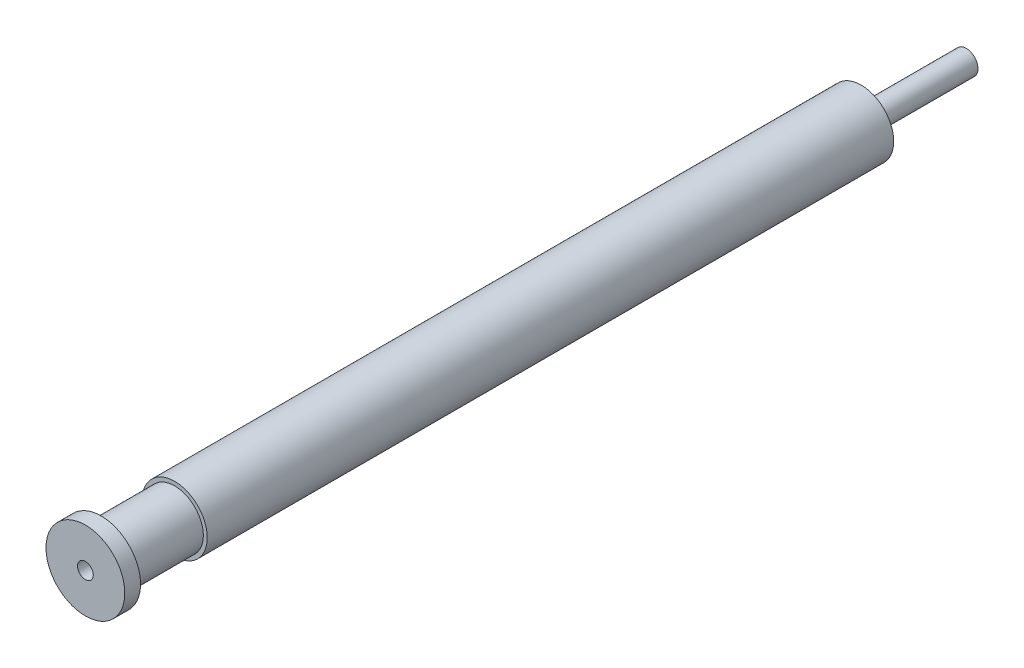
ISO-10303-21;
HEADER;
FILE_DESCRIPTION(('STEP AP214'),'2;1');
FILE_NAME('part.step','',(''),(''),'','','');
FILE_SCHEMA(('AUTOMOTIVE_DESIGN { 1 0 10303 214 1 1 1 1 }'));
ENDSEC;
DATA;
#1=APPLICATION_CONTEXT('core data for automotive mechanical design processes');
#2=APPLICATION_PROTOCOL_DEFINITION('international standard','automotive_design',2000,#1);
#3=PRODUCT_CONTEXT('',#1,'mechanical');
#4=PRODUCT('Part','Part','',(#3));
#5=PRODUCT_RELATED_PRODUCT_CATEGORY('part','',(#4));
#6=PRODUCT_DEFINITION_FORMATION('','',#4);
#7=PRODUCT_DEFINITION_CONTEXT('part definition',#1,'design');
#8=PRODUCT_DEFINITION('design','',#6,#7);
#9=PRODUCT_DEFINITION_SHAPE('','',#8);
#10=(LENGTH_UNIT() NAMED_UNIT(*) SI_UNIT(.MILLI.,.METRE.));
#11=(NAMED_UNIT(*) PLANE_ANGLE_UNIT() SI_UNIT($,.RADIAN.));
#12=(NAMED_UNIT(*) SI_UNIT($,.STERADIAN.) SOLID_ANGLE_UNIT());
#13=UNCERTAINTY_MEASURE_WITH_UNIT(LENGTH_MEASURE(1.E-05),#10,'distance_accuracy_value','');
#14=(GEOMETRIC_REPRESENTATION_CONTEXT(3) GLOBAL_UNCERTAINTY_ASSIGNED_CONTEXT((#13)) GLOBAL_UNIT_ASSIGNED_CONTEXT((#10,
#11,#12)) REPRESENTATION_CONTEXT('',''));
#15=CARTESIAN_POINT('',(0.,0.,0.));
#16=DIRECTION('',(0.,0.,1.));
#17=DIRECTION('',(1.,0.,0.));
#18=AXIS2_PLACEMENT_3D('',#15,#16,#17);
#19=CARTESIAN_POINT('',(25.9932499833334,0.,-27.8475545000964));
#20=DIRECTION('',(0.,0.,1.));
#21=DIRECTION('',(1.,0.,0.));
#22=AXIS2_PLACEMENT_3D('',#19,#20,#21);
#23=PLANE('',#22);
#24=CARTESIAN_POINT('',(24.8682499833335,0.,-27.8475545000964));
#25=DIRECTION('',(0.,0.,1.));
#26=DIRECTION('',(1.,0.,0.));
#27=AXIS2_PLACEMENT_3D('',#24,#25,#26);
#28=CIRCLE('',#27,0.750000000000002);
#29=CARTESIAN_POINT('',(25.6182499833335,0.,-27.8475545000964));
#30=VERTEX_POINT('',#29);
#31=EDGE_CURVE('E64',#30,#30,#28,.T.);
#32=ORIENTED_EDGE('',*,*,#31,.T.);
#33=EDGE_LOOP('',(#32));
#34=FACE_BOUND('',#33,.T.);
#35=CARTESIAN_POINT('',(24.8682499833334,0.,-27.8475545000964));
#36=DIRECTION('',(0.,0.,-1.));
#37=DIRECTION('',(-1.,0.,0.));
#38=AXIS2_PLACEMENT_3D('',#35,#36,#37);
#39=CIRCLE('',#38,1.12500000000001);
#40=CARTESIAN_POINT('',(23.7432499833334,0.,-27.8475545000964));
#41=VERTEX_POINT('',#40);
#42=EDGE_CURVE('E10',#41,#41,#39,.T.);
#43=ORIENTED_EDGE('',*,*,#42,.T.);
#44=EDGE_LOOP('',(#43));
#45=FACE_BOUND('',#44,.T.);
#46=ADVANCED_FACE('F33',(#34,#45),#23,.F.);
#47=CARTESIAN_POINT('',(24.8682499833334,0.,-17.0056108200556));
#48=DIRECTION('',(0.,0.,-1.));
#49=DIRECTION('',(-1.,0.,0.));
#50=AXIS2_PLACEMENT_3D('',#47,#48,#49);
#51=CYLINDRICAL_SURFACE('',#50,1.125);
#52=ORIENTED_EDGE('',*,*,#42,.F.);
#53=EDGE_LOOP('',(#52));
#54=FACE_BOUND('',#53,.T.);
#55=CARTESIAN_POINT('',(24.8682499833334,0.,-17.8475545000964));
#56=DIRECTION('',(0.,0.,-1.));
#57=DIRECTION('',(-1.,0.,0.));
#58=AXIS2_PLACEMENT_3D('',#55,#56,#57);
#59=CIRCLE('',#58,1.125);
#60=CARTESIAN_POINT('',(23.7432499833334,0.,-17.8475545000964));
#61=VERTEX_POINT('',#60);
#62=EDGE_CURVE('E39',#61,#61,#59,.T.);
#63=ORIENTED_EDGE('',*,*,#62,.T.);
#64=EDGE_LOOP('',(#63));
#65=FACE_BOUND('',#64,.T.);
#66=ADVANCED_FACE('F97',(#54,#65),#51,.T.);
#67=CARTESIAN_POINT('',(25.9932499833334,0.,-17.8475545000964));
#68=DIRECTION('',(0.,0.,1.));
#69=DIRECTION('',(1.,0.,0.));
#70=AXIS2_PLACEMENT_3D('',#67,#68,#69);
#71=PLANE('',#70);
#72=ORIENTED_EDGE('',*,*,#62,.F.);
#73=EDGE_LOOP('',(#72));
#74=FACE_BOUND('',#73,.T.);
#75=CARTESIAN_POINT('',(24.8682499833334,0.,-17.8475545000964));
#76=DIRECTION('',(0.,0.,-1.));
#77=DIRECTION('',(-1.,0.,0.));
#78=AXIS2_PLACEMENT_3D('',#75,#76,#77);
#79=CIRCLE('',#78,3.1);
#80=CARTESIAN_POINT('',(21.7682499833334,0.,-17.8475545000964));
#81=VERTEX_POINT('',#80);
#82=EDGE_CURVE('E43',#81,#81,#79,.T.);
#83=ORIENTED_EDGE('',*,*,#82,.T.);
#84=EDGE_LOOP('',(#83));
#85=FACE_BOUND('',#84,.T.);
#86=ADVANCED_FACE('F101',(#74,#85),#71,.F.);
#87=CARTESIAN_POINT('',(24.8682499833334,0.,-17.0056108200556));
#88=DIRECTION('',(0.,0.,-1.));
#89=DIRECTION('',(-1.,0.,0.));
#90=AXIS2_PLACEMENT_3D('',#87,#88,#89);
#91=CYLINDRICAL_SURFACE('',#90,3.1);
#92=ORIENTED_EDGE('',*,*,#82,.F.);
#93=EDGE_LOOP('',(#92));
#94=FACE_BOUND('',#93,.T.);
#95=CARTESIAN_POINT('',(24.8682499833335,0.,47.4943891799444));
#96=DIRECTION('',(0.,0.,-1.));
#97=DIRECTION('',(-1.,0.,0.));
#98=AXIS2_PLACEMENT_3D('',#95,#96,#97);
#99=CIRCLE('',#98,3.1);
#100=CARTESIAN_POINT('',(21.7682499833335,0.,47.4943891799444));
#101=VERTEX_POINT('',#100);
#102=EDGE_CURVE('E47',#101,#101,#99,.T.);
#103=ORIENTED_EDGE('',*,*,#102,.T.);
#104=EDGE_LOOP('',(#103));
#105=FACE_BOUND('',#104,.T.);
#106=ADVANCED_FACE('F106',(#94,#105),#91,.T.);
#107=CARTESIAN_POINT('',(27.5932499833334,0.,47.4943891799444));
#108=DIRECTION('',(0.,0.,-1.));
#109=DIRECTION('',(-1.,0.,0.));
#110=AXIS2_PLACEMENT_3D('',#107,#108,#109);
#111=PLANE('',#110);
#112=ORIENTED_EDGE('',*,*,#102,.F.);
#113=EDGE_LOOP('',(#112));
#114=FACE_BOUND('',#113,.T.);
#115=CARTESIAN_POINT('',(24.8682499833335,0.,47.4943891799444));
#116=DIRECTION('',(0.,0.,-1.));
#117=DIRECTION('',(-1.,0.,0.));
#118=AXIS2_PLACEMENT_3D('',#115,#116,#117);
#119=CIRCLE('',#118,2.72499999999999);
#120=CARTESIAN_POINT('',(22.1432499833335,0.,47.4943891799444));
#121=VERTEX_POINT('',#120);
#122=EDGE_CURVE('E52',#121,#121,#119,.T.);
#123=ORIENTED_EDGE('',*,*,#122,.T.);
#124=EDGE_LOOP('',(#123));
#125=FACE_BOUND('',#124,.T.);
#126=ADVANCED_FACE('F112',(#114,#125),#111,.F.);
#127=CARTESIAN_POINT('',(24.8682499833334,0.,-17.0056108200556));
#128=DIRECTION('',(0.,0.,-1.));
#129=DIRECTION('',(-1.,0.,0.));
#130=AXIS2_PLACEMENT_3D('',#127,#128,#129);
#131=CYLINDRICAL_SURFACE('',#130,2.72499999999999);
#132=ORIENTED_EDGE('',*,*,#122,.F.);
#133=EDGE_LOOP('',(#132));
#134=FACE_BOUND('',#133,.T.);
#135=CARTESIAN_POINT('',(24.8682499833335,0.,54.4943891799444));
#136=DIRECTION('',(0.,0.,-1.));
#137=DIRECTION('',(-1.,0.,0.));
#138=AXIS2_PLACEMENT_3D('',#135,#136,#137);
#139=CIRCLE('',#138,2.72499999999999);
#140=CARTESIAN_POINT('',(22.1432499833335,0.,54.4943891799444));
#141=VERTEX_POINT('',#140);
#142=EDGE_CURVE('E55',#141,#141,#139,.T.);
#143=ORIENTED_EDGE('',*,*,#142,.T.);
#144=EDGE_LOOP('',(#143));
#145=FACE_BOUND('',#144,.T.);
#146=ADVANCED_FACE('F92',(#134,#145),#131,.T.);
#147=CARTESIAN_POINT('',(27.5932499833335,0.,54.4943891799444));
#148=DIRECTION('',(0.,0.,1.));
#149=DIRECTION('',(1.,0.,0.));
#150=AXIS2_PLACEMENT_3D('',#147,#148,#149);
#151=PLANE('',#150);
#152=ORIENTED_EDGE('',*,*,#142,.F.);
#153=EDGE_LOOP('',(#152));
#154=FACE_BOUND('',#153,.T.);
#155=CARTESIAN_POINT('',(24.8682499833335,0.,54.4943891799444));
#156=DIRECTION('',(0.,0.,-1.));
#157=DIRECTION('',(-1.,0.,0.));
#158=AXIS2_PLACEMENT_3D('',#155,#156,#157);
#159=CIRCLE('',#158,3.75);
#160=CARTESIAN_POINT('',(21.1182499833335,0.,54.4943891799444));
#161=VERTEX_POINT('',#160);
#162=EDGE_CURVE('E58',#161,#161,#159,.T.);
#163=ORIENTED_EDGE('',*,*,#162,.T.);
#164=EDGE_LOOP('',(#163));
#165=FACE_BOUND('',#164,.T.);
#166=ADVANCED_FACE('F86',(#154,#165),#151,.F.);
#167=CARTESIAN_POINT('',(24.8682499833334,0.,-17.0056108200556));
#168=DIRECTION('',(0.,0.,-1.));
#169=DIRECTION('',(-1.,0.,0.));
#170=AXIS2_PLACEMENT_3D('',#167,#168,#169);
#171=CYLINDRICAL_SURFACE('',#170,3.75);
#172=ORIENTED_EDGE('',*,*,#162,.F.);
#173=EDGE_LOOP('',(#172));
#174=FACE_BOUND('',#173,.T.);
#175=CARTESIAN_POINT('',(24.8682499833335,0.,55.9943891799444));
#176=DIRECTION('',(0.,0.,-1.));
#177=DIRECTION('',(-1.,0.,0.));
#178=AXIS2_PLACEMENT_3D('',#175,#176,#177);
#179=CIRCLE('',#178,3.75);
#180=CARTESIAN_POINT('',(21.1182499833335,0.,55.9943891799444));
#181=VERTEX_POINT('',#180);
#182=EDGE_CURVE('E61',#181,#181,#179,.T.);
#183=ORIENTED_EDGE('',*,*,#182,.T.);
#184=EDGE_LOOP('',(#183));
#185=FACE_BOUND('',#184,.T.);
#186=ADVANCED_FACE('F81',(#174,#185),#171,.T.);
#187=CARTESIAN_POINT('',(28.6182499833335,0.,55.9943891799444));
#188=DIRECTION('',(0.,0.,-1.));
#189=DIRECTION('',(-1.,0.,0.));
#190=AXIS2_PLACEMENT_3D('',#187,#188,#189);
#191=PLANE('',#190);
#192=CARTESIAN_POINT('',(24.8682499833335,0.,55.9943891799444));
#193=DIRECTION('',(0.,0.,1.));
#194=DIRECTION('',(1.,0.,0.));
#195=AXIS2_PLACEMENT_3D('',#192,#193,#194);
#196=CIRCLE('',#195,0.750000000000002);
#197=CARTESIAN_POINT('',(25.6182499833335,0.,55.9943891799444));
#198=VERTEX_POINT('',#197);
#199=EDGE_CURVE('E65',#198,#198,#196,.T.);
#200=ORIENTED_EDGE('',*,*,#199,.F.);
#201=EDGE_LOOP('',(#200));
#202=FACE_BOUND('',#201,.T.);
#203=ORIENTED_EDGE('',*,*,#182,.F.);
#204=EDGE_LOOP('',(#203));
#205=FACE_BOUND('',#204,.T.);
#206=ADVANCED_FACE('F75',(#202,#205),#191,.F.);
#207=CARTESIAN_POINT('',(24.8682499833335,0.,-27.8475545000964));
#208=DIRECTION('',(0.,0.,1.));
#209=DIRECTION('',(1.,0.,0.));
#210=AXIS2_PLACEMENT_3D('',#207,#208,#209);
#211=CYLINDRICAL_SURFACE('',#210,0.750000000000002);
#212=ORIENTED_EDGE('',*,*,#31,.F.);
#213=EDGE_LOOP('',(#212));
#214=FACE_BOUND('',#213,.T.);
#215=ORIENTED_EDGE('',*,*,#199,.T.);
#216=EDGE_LOOP('',(#215));
#217=FACE_BOUND('',#216,.T.);
#218=ADVANCED_FACE('F72',(#214,#217),#211,.F.);
#219=CLOSED_SHELL('',(#46,#66,#86,#106,#126,#146,#166,#186,#206,#218));
#220=MANIFOLD_SOLID_BREP('B2',#219);
#221=ADVANCED_BREP_SHAPE_REPRESENTATION('',(#18,#220),#14);
#222=SHAPE_DEFINITION_REPRESENTATION(#9,#221);
ENDSEC;
END-ISO-10303-21;
